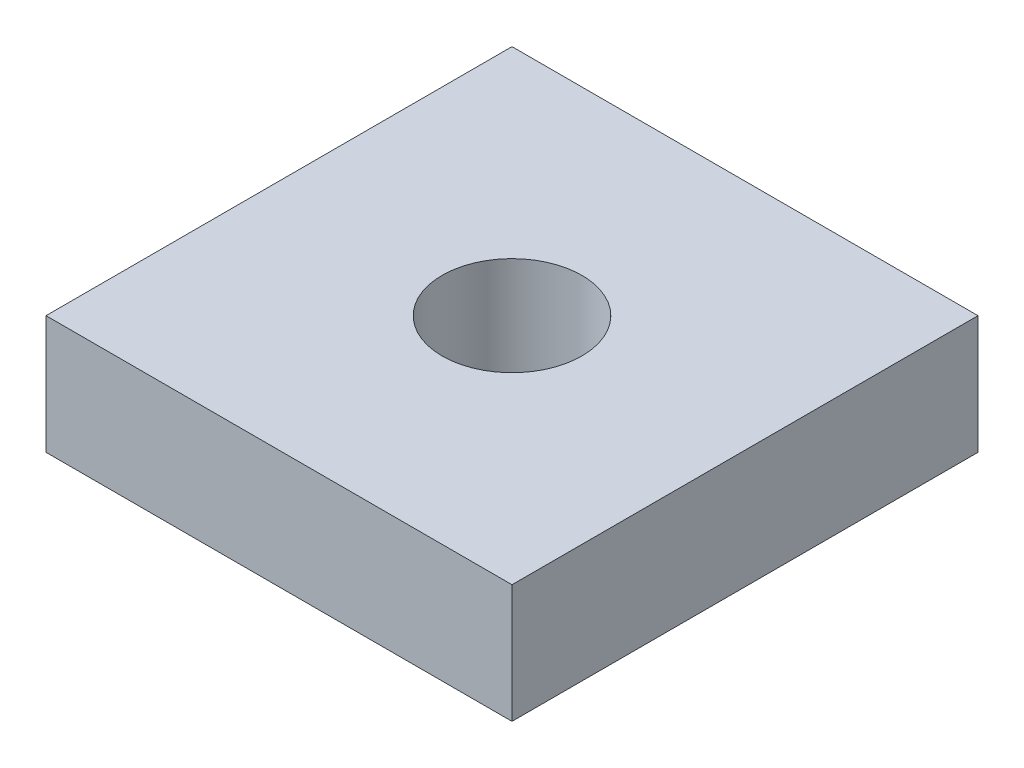
ISO-10303-21;
HEADER;
FILE_DESCRIPTION(('STEP AP214'),'2;1');
FILE_NAME('part.step','',(''),(''),'','','');
FILE_SCHEMA(('AUTOMOTIVE_DESIGN { 1 0 10303 214 1 1 1 1 }'));
ENDSEC;
DATA;
#1=APPLICATION_CONTEXT('core data for automotive mechanical design processes');
#2=APPLICATION_PROTOCOL_DEFINITION('international standard','automotive_design',2000,#1);
#3=PRODUCT_CONTEXT('',#1,'mechanical');
#4=PRODUCT('Part','Part','',(#3));
#5=PRODUCT_RELATED_PRODUCT_CATEGORY('part','',(#4));
#6=PRODUCT_DEFINITION_FORMATION('','',#4);
#7=PRODUCT_DEFINITION_CONTEXT('part definition',#1,'design');
#8=PRODUCT_DEFINITION('design','',#6,#7);
#9=PRODUCT_DEFINITION_SHAPE('','',#8);
#10=(LENGTH_UNIT() NAMED_UNIT(*) SI_UNIT(.MILLI.,.METRE.));
#11=(NAMED_UNIT(*) PLANE_ANGLE_UNIT() SI_UNIT($,.RADIAN.));
#12=(NAMED_UNIT(*) SI_UNIT($,.STERADIAN.) SOLID_ANGLE_UNIT());
#13=UNCERTAINTY_MEASURE_WITH_UNIT(LENGTH_MEASURE(1.E-05),#10,'distance_accuracy_value','');
#14=(GEOMETRIC_REPRESENTATION_CONTEXT(3) GLOBAL_UNCERTAINTY_ASSIGNED_CONTEXT((#13)) GLOBAL_UNIT_ASSIGNED_CONTEXT((#10,
#11,#12)) REPRESENTATION_CONTEXT('',''));
#15=CARTESIAN_POINT('',(0.,0.,0.));
#16=DIRECTION('',(0.,0.,1.));
#17=DIRECTION('',(1.,0.,0.));
#18=AXIS2_PLACEMENT_3D('',#15,#16,#17);
#19=CARTESIAN_POINT('',(0.,2.54,0.));
#20=DIRECTION('',(0.,1.,0.));
#21=DIRECTION('',(0.,0.,1.));
#22=AXIS2_PLACEMENT_3D('',#19,#20,#21);
#23=PLANE('',#22);
#24=DIRECTION('',(0.,0.,1.));
#25=VECTOR('',#24,1.);
#26=CARTESIAN_POINT('',(-4.05144694533762,2.54,-3.55305466237942));
#27=LINE('',#26,#25);
#28=CARTESIAN_POINT('',(-4.05144694533762,2.54,-3.55305466237942));
#29=VERTEX_POINT('',#28);
#30=CARTESIAN_POINT('',(-4.05144694533762,2.54,6.44694533762058));
#31=VERTEX_POINT('',#30);
#32=EDGE_CURVE('E93',#29,#31,#27,.T.);
#33=ORIENTED_EDGE('',*,*,#32,.T.);
#34=DIRECTION('',(1.,0.,0.));
#35=VECTOR('',#34,1.);
#36=CARTESIAN_POINT('',(-4.05144694533762,2.54,6.44694533762058));
#37=LINE('',#36,#35);
#38=CARTESIAN_POINT('',(5.94855305466238,2.54,6.44694533762058));
#39=VERTEX_POINT('',#38);
#40=EDGE_CURVE('E88',#31,#39,#37,.T.);
#41=ORIENTED_EDGE('',*,*,#40,.T.);
#42=DIRECTION('',(0.,0.,-1.));
#43=VECTOR('',#42,1.);
#44=CARTESIAN_POINT('',(5.94855305466238,2.54,-3.55305466237942));
#45=LINE('',#44,#43);
#46=CARTESIAN_POINT('',(5.94855305466238,2.54,-3.55305466237942));
#47=VERTEX_POINT('',#46);
#48=EDGE_CURVE('E91',#39,#47,#45,.T.);
#49=ORIENTED_EDGE('',*,*,#48,.T.);
#50=DIRECTION('',(-1.,0.,0.));
#51=VECTOR('',#50,1.);
#52=CARTESIAN_POINT('',(-4.05144694533762,2.54,-3.55305466237942));
#53=LINE('',#52,#51);
#54=EDGE_CURVE('E58',#47,#29,#53,.T.);
#55=ORIENTED_EDGE('',*,*,#54,.T.);
#56=EDGE_LOOP('',(#33,#41,#49,#55));
#57=FACE_BOUND('',#56,.T.);
#58=CARTESIAN_POINT('',(0.948553054662379,2.54,1.44694533762058));
#59=DIRECTION('',(0.,1.,0.));
#60=DIRECTION('',(0.,0.,1.));
#61=AXIS2_PLACEMENT_3D('',#58,#59,#60);
#62=CIRCLE('',#61,1.5);
#63=CARTESIAN_POINT('',(0.948553054662379,2.54,2.94694533762058));
#64=VERTEX_POINT('',#63);
#65=EDGE_CURVE('E121',#64,#64,#62,.T.);
#66=ORIENTED_EDGE('',*,*,#65,.F.);
#67=EDGE_LOOP('',(#66));
#68=FACE_BOUND('',#67,.T.);
#69=ADVANCED_FACE('F40',(#57,#68),#23,.T.);
#70=CARTESIAN_POINT('',(0.,0.,0.));
#71=DIRECTION('',(0.,1.,0.));
#72=DIRECTION('',(0.,0.,1.));
#73=AXIS2_PLACEMENT_3D('',#70,#71,#72);
#74=PLANE('',#73);
#75=DIRECTION('',(0.,0.,1.));
#76=VECTOR('',#75,1.);
#77=CARTESIAN_POINT('',(-4.05144694533762,0.,-3.55305466237942));
#78=LINE('',#77,#76);
#79=CARTESIAN_POINT('',(-4.05144694533762,0.,-3.55305466237942));
#80=VERTEX_POINT('',#79);
#81=CARTESIAN_POINT('',(-4.05144694533762,0.,6.44694533762058));
#82=VERTEX_POINT('',#81);
#83=EDGE_CURVE('E125',#80,#82,#78,.T.);
#84=ORIENTED_EDGE('',*,*,#83,.F.);
#85=DIRECTION('',(-1.,0.,0.));
#86=VECTOR('',#85,1.);
#87=CARTESIAN_POINT('',(-4.05144694533762,0.,-3.55305466237942));
#88=LINE('',#87,#86);
#89=CARTESIAN_POINT('',(5.94855305466238,0.,-3.55305466237942));
#90=VERTEX_POINT('',#89);
#91=EDGE_CURVE('E81',#90,#80,#88,.T.);
#92=ORIENTED_EDGE('',*,*,#91,.F.);
#93=DIRECTION('',(0.,0.,-1.));
#94=VECTOR('',#93,1.);
#95=CARTESIAN_POINT('',(5.94855305466238,0.,-3.55305466237942));
#96=LINE('',#95,#94);
#97=CARTESIAN_POINT('',(5.94855305466238,0.,6.44694533762058));
#98=VERTEX_POINT('',#97);
#99=EDGE_CURVE('E75',#98,#90,#96,.T.);
#100=ORIENTED_EDGE('',*,*,#99,.F.);
#101=DIRECTION('',(1.,0.,0.));
#102=VECTOR('',#101,1.);
#103=CARTESIAN_POINT('',(-4.05144694533762,0.,6.44694533762058));
#104=LINE('',#103,#102);
#105=EDGE_CURVE('E98',#82,#98,#104,.T.);
#106=ORIENTED_EDGE('',*,*,#105,.F.);
#107=EDGE_LOOP('',(#84,#92,#100,#106));
#108=FACE_BOUND('',#107,.T.);
#109=CARTESIAN_POINT('',(0.948553054662379,0.,1.44694533762058));
#110=DIRECTION('',(0.,1.,0.));
#111=DIRECTION('',(0.,0.,1.));
#112=AXIS2_PLACEMENT_3D('',#109,#110,#111);
#113=CIRCLE('',#112,1.5);
#114=CARTESIAN_POINT('',(0.948553054662379,0.,2.94694533762058));
#115=VERTEX_POINT('',#114);
#116=EDGE_CURVE('E118',#115,#115,#113,.T.);
#117=ORIENTED_EDGE('',*,*,#116,.T.);
#118=EDGE_LOOP('',(#117));
#119=FACE_BOUND('',#118,.T.);
#120=ADVANCED_FACE('F144',(#108,#119),#74,.F.);
#121=CARTESIAN_POINT('',(-4.05144694533762,2.54,-3.55305466237942));
#122=DIRECTION('',(1.,0.,0.));
#123=DIRECTION('',(0.,0.,-1.));
#124=AXIS2_PLACEMENT_3D('',#121,#122,#123);
#125=PLANE('',#124);
#126=ORIENTED_EDGE('',*,*,#83,.T.);
#127=DIRECTION('',(0.,-1.,0.));
#128=VECTOR('',#127,1.);
#129=CARTESIAN_POINT('',(-4.05144694533762,2.54,6.44694533762058));
#130=LINE('',#129,#128);
#131=EDGE_CURVE('E12',#31,#82,#130,.T.);
#132=ORIENTED_EDGE('',*,*,#131,.F.);
#133=ORIENTED_EDGE('',*,*,#32,.F.);
#134=DIRECTION('',(0.,-1.,0.));
#135=VECTOR('',#134,1.);
#136=CARTESIAN_POINT('',(-4.05144694533762,2.54,-3.55305466237942));
#137=LINE('',#136,#135);
#138=EDGE_CURVE('E105',#29,#80,#137,.T.);
#139=ORIENTED_EDGE('',*,*,#138,.T.);
#140=EDGE_LOOP('',(#126,#132,#133,#139));
#141=FACE_BOUND('',#140,.T.);
#142=ADVANCED_FACE('F42',(#141),#125,.F.);
#143=CARTESIAN_POINT('',(-4.05144694533762,2.54,6.44694533762058));
#144=DIRECTION('',(0.,0.,-1.));
#145=DIRECTION('',(-1.,0.,0.));
#146=AXIS2_PLACEMENT_3D('',#143,#144,#145);
#147=PLANE('',#146);
#148=ORIENTED_EDGE('',*,*,#105,.T.);
#149=DIRECTION('',(0.,-1.,0.));
#150=VECTOR('',#149,1.);
#151=CARTESIAN_POINT('',(5.94855305466238,2.54,6.44694533762058));
#152=LINE('',#151,#150);
#153=EDGE_CURVE('E50',#39,#98,#152,.T.);
#154=ORIENTED_EDGE('',*,*,#153,.F.);
#155=ORIENTED_EDGE('',*,*,#40,.F.);
#156=ORIENTED_EDGE('',*,*,#131,.T.);
#157=EDGE_LOOP('',(#148,#154,#155,#156));
#158=FACE_BOUND('',#157,.T.);
#159=ADVANCED_FACE('F97',(#158),#147,.F.);
#160=CARTESIAN_POINT('',(5.94855305466238,2.54,-3.55305466237942));
#161=DIRECTION('',(-1.,0.,0.));
#162=DIRECTION('',(0.,0.,1.));
#163=AXIS2_PLACEMENT_3D('',#160,#161,#162);
#164=PLANE('',#163);
#165=ORIENTED_EDGE('',*,*,#99,.T.);
#166=DIRECTION('',(0.,-1.,0.));
#167=VECTOR('',#166,1.);
#168=CARTESIAN_POINT('',(5.94855305466238,2.54,-3.55305466237942));
#169=LINE('',#168,#167);
#170=EDGE_CURVE('E100',#47,#90,#169,.T.);
#171=ORIENTED_EDGE('',*,*,#170,.F.);
#172=ORIENTED_EDGE('',*,*,#48,.F.);
#173=ORIENTED_EDGE('',*,*,#153,.T.);
#174=EDGE_LOOP('',(#165,#171,#172,#173));
#175=FACE_BOUND('',#174,.T.);
#176=ADVANCED_FACE('F101',(#175),#164,.F.);
#177=CARTESIAN_POINT('',(-4.05144694533762,2.54,-3.55305466237942));
#178=DIRECTION('',(0.,0.,1.));
#179=DIRECTION('',(1.,0.,0.));
#180=AXIS2_PLACEMENT_3D('',#177,#178,#179);
#181=PLANE('',#180);
#182=ORIENTED_EDGE('',*,*,#91,.T.);
#183=ORIENTED_EDGE('',*,*,#138,.F.);
#184=ORIENTED_EDGE('',*,*,#54,.F.);
#185=ORIENTED_EDGE('',*,*,#170,.T.);
#186=EDGE_LOOP('',(#182,#183,#184,#185));
#187=FACE_BOUND('',#186,.T.);
#188=ADVANCED_FACE('F142',(#187),#181,.F.);
#189=CARTESIAN_POINT('',(0.948553054662379,2.54,1.44694533762058));
#190=DIRECTION('',(0.,-1.,0.));
#191=DIRECTION('',(0.,0.,-1.));
#192=AXIS2_PLACEMENT_3D('',#189,#190,#191);
#193=CYLINDRICAL_SURFACE('',#192,1.5);
#194=ORIENTED_EDGE('',*,*,#65,.T.);
#195=EDGE_LOOP('',(#194));
#196=FACE_BOUND('',#195,.T.);
#197=ORIENTED_EDGE('',*,*,#116,.F.);
#198=EDGE_LOOP('',(#197));
#199=FACE_BOUND('',#198,.T.);
#200=ADVANCED_FACE('F157',(#196,#199),#193,.F.);
#201=CLOSED_SHELL('',(#69,#120,#142,#159,#176,#188,#200));
#202=MANIFOLD_SOLID_BREP('B2',#201);
#203=ADVANCED_BREP_SHAPE_REPRESENTATION('',(#18,#202),#14);
#204=SHAPE_DEFINITION_REPRESENTATION(#9,#203);
ENDSEC;
END-ISO-10303-21;
